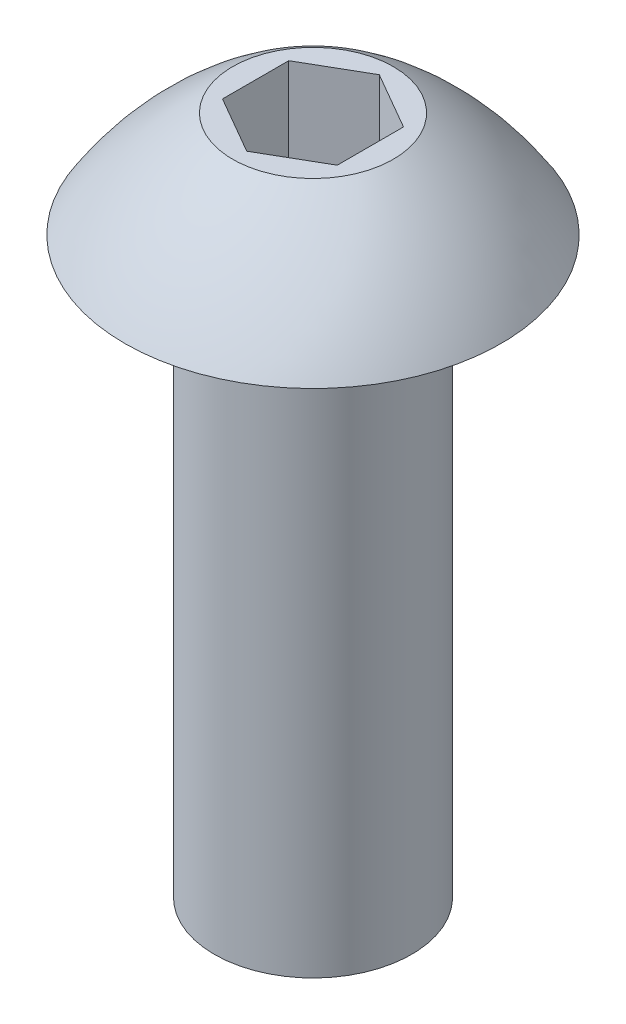
ISO-10303-21;
HEADER;
FILE_DESCRIPTION(('STEP AP214'),'2;1');
FILE_NAME('part.step','',(''),(''),'','','');
FILE_SCHEMA(('AUTOMOTIVE_DESIGN { 1 0 10303 214 1 1 1 1 }'));
ENDSEC;
DATA;
#1=APPLICATION_CONTEXT('core data for automotive mechanical design processes');
#2=APPLICATION_PROTOCOL_DEFINITION('international standard','automotive_design',2000,#1);
#3=PRODUCT_CONTEXT('',#1,'mechanical');
#4=PRODUCT('Part','Part','',(#3));
#5=PRODUCT_RELATED_PRODUCT_CATEGORY('part','',(#4));
#6=PRODUCT_DEFINITION_FORMATION('','',#4);
#7=PRODUCT_DEFINITION_CONTEXT('part definition',#1,'design');
#8=PRODUCT_DEFINITION('design','',#6,#7);
#9=PRODUCT_DEFINITION_SHAPE('','',#8);
#10=(LENGTH_UNIT() NAMED_UNIT(*) SI_UNIT(.MILLI.,.METRE.));
#11=(NAMED_UNIT(*) PLANE_ANGLE_UNIT() SI_UNIT($,.RADIAN.));
#12=(NAMED_UNIT(*) SI_UNIT($,.STERADIAN.) SOLID_ANGLE_UNIT());
#13=UNCERTAINTY_MEASURE_WITH_UNIT(LENGTH_MEASURE(1.E-05),#10,'distance_accuracy_value','');
#14=(GEOMETRIC_REPRESENTATION_CONTEXT(3) GLOBAL_UNCERTAINTY_ASSIGNED_CONTEXT((#13)) GLOBAL_UNIT_ASSIGNED_CONTEXT((#10,
#11,#12)) REPRESENTATION_CONTEXT('',''));
#15=CARTESIAN_POINT('',(0.,0.,0.));
#16=DIRECTION('',(0.,0.,1.));
#17=DIRECTION('',(1.,0.,0.));
#18=AXIS2_PLACEMENT_3D('',#15,#16,#17);
#19=CARTESIAN_POINT('',(0.,-6.35,0.));
#20=DIRECTION('',(0.,-1.,0.));
#21=DIRECTION('',(0.,0.,-1.));
#22=AXIS2_PLACEMENT_3D('',#19,#20,#21);
#23=CYLINDRICAL_SURFACE('',#22,1.0922);
#24=CARTESIAN_POINT('',(0.,-6.35,0.));
#25=DIRECTION('',(0.,-1.,0.));
#26=DIRECTION('',(0.,0.,-1.));
#27=AXIS2_PLACEMENT_3D('',#24,#25,#26);
#28=CIRCLE('',#27,1.0922);
#29=CARTESIAN_POINT('',(0.,-6.35,-1.0922));
#30=VERTEX_POINT('',#29);
#31=EDGE_CURVE('E135',#30,#30,#28,.T.);
#32=ORIENTED_EDGE('',*,*,#31,.F.);
#33=EDGE_LOOP('',(#32));
#34=FACE_BOUND('',#33,.T.);
#35=CARTESIAN_POINT('',(0.,0.,0.));
#36=DIRECTION('',(0.,-1.,0.));
#37=DIRECTION('',(0.,0.,-1.));
#38=AXIS2_PLACEMENT_3D('',#35,#36,#37);
#39=CIRCLE('',#38,1.0922);
#40=CARTESIAN_POINT('',(0.,0.,-1.0922));
#41=VERTEX_POINT('',#40);
#42=EDGE_CURVE('E11',#41,#41,#39,.T.);
#43=ORIENTED_EDGE('',*,*,#42,.T.);
#44=EDGE_LOOP('',(#43));
#45=FACE_BOUND('',#44,.T.);
#46=ADVANCED_FACE('F34',(#34,#45),#23,.T.);
#47=CARTESIAN_POINT('',(-1.0922,0.,0.));
#48=DIRECTION('',(0.,1.,0.));
#49=DIRECTION('',(0.,0.,1.));
#50=AXIS2_PLACEMENT_3D('',#47,#48,#49);
#51=PLANE('',#50);
#52=ORIENTED_EDGE('',*,*,#42,.F.);
#53=EDGE_LOOP('',(#52));
#54=FACE_BOUND('',#53,.T.);
#55=CARTESIAN_POINT('',(0.,0.,0.));
#56=DIRECTION('',(0.,-1.,0.));
#57=DIRECTION('',(0.,0.,-1.));
#58=AXIS2_PLACEMENT_3D('',#55,#56,#57);
#59=CIRCLE('',#58,2.0828);
#60=CARTESIAN_POINT('',(0.,0.,-2.0828));
#61=VERTEX_POINT('',#60);
#62=EDGE_CURVE('E41',#61,#61,#59,.T.);
#63=ORIENTED_EDGE('',*,*,#62,.T.);
#64=EDGE_LOOP('',(#63));
#65=FACE_BOUND('',#64,.T.);
#66=ADVANCED_FACE('F148',(#54,#65),#51,.F.);
#67=CARTESIAN_POINT('',(0.,-1.88994850901782,0.));
#68=DIRECTION('',(0.,-1.,0.));
#69=DIRECTION('',(0.,0.,-1.));
#70=AXIS2_PLACEMENT_3D('',#67,#68,#69);
#71=DEGENERATE_TOROIDAL_SURFACE('',#70,0.935607051379142,3.5612759643917,.F.);
#72=ORIENTED_EDGE('',*,*,#62,.F.);
#73=EDGE_LOOP('',(#72));
#74=FACE_BOUND('',#73,.T.);
#75=CARTESIAN_POINT('',(0.,1.1684,0.));
#76=DIRECTION('',(0.,-1.,0.));
#77=DIRECTION('',(0.,0.,-1.));
#78=AXIS2_PLACEMENT_3D('',#75,#76,#77);
#79=CIRCLE('',#78,0.889);
#80=CARTESIAN_POINT('',(0.,1.1684,-0.889));
#81=VERTEX_POINT('',#80);
#82=EDGE_CURVE('E143',#81,#81,#79,.T.);
#83=ORIENTED_EDGE('',*,*,#82,.T.);
#84=EDGE_LOOP('',(#83));
#85=FACE_BOUND('',#84,.T.);
#86=ADVANCED_FACE('F150',(#74,#85),#71,.F.);
#87=CARTESIAN_POINT('',(0.,1.1684,0.));
#88=DIRECTION('',(0.,-1.,0.));
#89=DIRECTION('',(0.,0.,-1.));
#90=AXIS2_PLACEMENT_3D('',#87,#88,#89);
#91=PLANE('',#90);
#92=DIRECTION('',(0.,0.,1.));
#93=VECTOR('',#92,1.);
#94=CARTESIAN_POINT('',(-0.635,1.1684,-0.366617420935412));
#95=LINE('',#94,#93);
#96=CARTESIAN_POINT('',(-0.635,1.1684,-0.366617420935412));
#97=VERTEX_POINT('',#96);
#98=CARTESIAN_POINT('',(-0.635,1.1684,0.366617420935412));
#99=VERTEX_POINT('',#98);
#100=EDGE_CURVE('E122',#97,#99,#95,.T.);
#101=ORIENTED_EDGE('',*,*,#100,.F.);
#102=DIRECTION('',(-0.866025403784438,0.,0.5));
#103=VECTOR('',#102,1.);
#104=CARTESIAN_POINT('',(0.,1.1684,-0.733234841870825));
#105=LINE('',#104,#103);
#106=CARTESIAN_POINT('',(0.,1.1684,-0.733234841870825));
#107=VERTEX_POINT('',#106);
#108=EDGE_CURVE('E48',#107,#97,#105,.T.);
#109=ORIENTED_EDGE('',*,*,#108,.F.);
#110=DIRECTION('',(-0.866025403784439,0.,-0.5));
#111=VECTOR('',#110,1.);
#112=CARTESIAN_POINT('',(0.635,1.1684,-0.366617420935413));
#113=LINE('',#112,#111);
#114=CARTESIAN_POINT('',(0.635,1.1684,-0.366617420935413));
#115=VERTEX_POINT('',#114);
#116=EDGE_CURVE('E131',#115,#107,#113,.T.);
#117=ORIENTED_EDGE('',*,*,#116,.F.);
#118=DIRECTION('',(0.,0.,-1.));
#119=VECTOR('',#118,1.);
#120=CARTESIAN_POINT('',(0.635,1.1684,0.366617420935412));
#121=LINE('',#120,#119);
#122=CARTESIAN_POINT('',(0.635,1.1684,0.366617420935412));
#123=VERTEX_POINT('',#122);
#124=EDGE_CURVE('E129',#123,#115,#121,.T.);
#125=ORIENTED_EDGE('',*,*,#124,.F.);
#126=DIRECTION('',(0.866025403784439,0.,-0.5));
#127=VECTOR('',#126,1.);
#128=CARTESIAN_POINT('',(0.,1.1684,0.733234841870825));
#129=LINE('',#128,#127);
#130=CARTESIAN_POINT('',(0.,1.1684,0.733234841870825));
#131=VERTEX_POINT('',#130);
#132=EDGE_CURVE('E96',#131,#123,#129,.T.);
#133=ORIENTED_EDGE('',*,*,#132,.F.);
#134=DIRECTION('',(0.866025403784439,0.,0.5));
#135=VECTOR('',#134,1.);
#136=CARTESIAN_POINT('',(-0.635,1.1684,0.366617420935412));
#137=LINE('',#136,#135);
#138=EDGE_CURVE('E125',#99,#131,#137,.T.);
#139=ORIENTED_EDGE('',*,*,#138,.F.);
#140=EDGE_LOOP('',(#101,#109,#117,#125,#133,#139));
#141=FACE_BOUND('',#140,.T.);
#142=ORIENTED_EDGE('',*,*,#82,.F.);
#143=EDGE_LOOP('',(#142));
#144=FACE_BOUND('',#143,.T.);
#145=ADVANCED_FACE('F153',(#141,#144),#91,.F.);
#146=CARTESIAN_POINT('',(-1.0922,-6.35,0.));
#147=DIRECTION('',(0.,1.,0.));
#148=DIRECTION('',(0.,0.,1.));
#149=AXIS2_PLACEMENT_3D('',#146,#147,#148);
#150=PLANE('',#149);
#151=ORIENTED_EDGE('',*,*,#31,.T.);
#152=EDGE_LOOP('',(#151));
#153=FACE_BOUND('',#152,.T.);
#154=ADVANCED_FACE('F158',(#153),#150,.F.);
#155=CARTESIAN_POINT('',(0.,-0.1016,-0.733234841870825));
#156=DIRECTION('',(-0.5,0.,-0.866025403784439));
#157=DIRECTION('',(-0.866025403784439,0.,0.5));
#158=AXIS2_PLACEMENT_3D('',#155,#156,#157);
#159=PLANE('',#158);
#160=ORIENTED_EDGE('',*,*,#108,.T.);
#161=DIRECTION('',(0.,1.,0.));
#162=VECTOR('',#161,1.);
#163=CARTESIAN_POINT('',(-0.635,-0.1016,-0.366617420935412));
#164=LINE('',#163,#162);
#165=CARTESIAN_POINT('',(-0.635,-0.1016,-0.366617420935412));
#166=VERTEX_POINT('',#165);
#167=EDGE_CURVE('E78',#166,#97,#164,.T.);
#168=ORIENTED_EDGE('',*,*,#167,.F.);
#169=DIRECTION('',(-0.866025403784438,0.,0.5));
#170=VECTOR('',#169,1.);
#171=CARTESIAN_POINT('',(0.,-0.1016,-0.733234841870825));
#172=LINE('',#171,#170);
#173=CARTESIAN_POINT('',(0.,-0.1016,-0.733234841870825));
#174=VERTEX_POINT('',#173);
#175=EDGE_CURVE('E133',#174,#166,#172,.T.);
#176=ORIENTED_EDGE('',*,*,#175,.F.);
#177=DIRECTION('',(0.,1.,0.));
#178=VECTOR('',#177,1.);
#179=CARTESIAN_POINT('',(0.,-0.1016,-0.733234841870825));
#180=LINE('',#179,#178);
#181=EDGE_CURVE('E56',#174,#107,#180,.T.);
#182=ORIENTED_EDGE('',*,*,#181,.T.);
#183=EDGE_LOOP('',(#160,#168,#176,#182));
#184=FACE_BOUND('',#183,.T.);
#185=ADVANCED_FACE('F164',(#184),#159,.F.);
#186=CARTESIAN_POINT('',(0.635,-0.1016,-0.366617420935413));
#187=DIRECTION('',(0.5,0.,-0.866025403784439));
#188=DIRECTION('',(-0.866025403784439,0.,-0.5));
#189=AXIS2_PLACEMENT_3D('',#186,#187,#188);
#190=PLANE('',#189);
#191=ORIENTED_EDGE('',*,*,#116,.T.);
#192=ORIENTED_EDGE('',*,*,#181,.F.);
#193=DIRECTION('',(-0.866025403784439,0.,-0.5));
#194=VECTOR('',#193,1.);
#195=CARTESIAN_POINT('',(0.635,-0.1016,-0.366617420935413));
#196=LINE('',#195,#194);
#197=CARTESIAN_POINT('',(0.635,-0.1016,-0.366617420935413));
#198=VERTEX_POINT('',#197);
#199=EDGE_CURVE('E108',#198,#174,#196,.T.);
#200=ORIENTED_EDGE('',*,*,#199,.F.);
#201=DIRECTION('',(0.,1.,0.));
#202=VECTOR('',#201,1.);
#203=CARTESIAN_POINT('',(0.635,-0.1016,-0.366617420935413));
#204=LINE('',#203,#202);
#205=EDGE_CURVE('E100',#198,#115,#204,.T.);
#206=ORIENTED_EDGE('',*,*,#205,.T.);
#207=EDGE_LOOP('',(#191,#192,#200,#206));
#208=FACE_BOUND('',#207,.T.);
#209=ADVANCED_FACE('F202',(#208),#190,.F.);
#210=CARTESIAN_POINT('',(0.635,-0.1016,0.366617420935412));
#211=DIRECTION('',(1.,0.,0.));
#212=DIRECTION('',(0.,0.,-1.));
#213=AXIS2_PLACEMENT_3D('',#210,#211,#212);
#214=PLANE('',#213);
#215=ORIENTED_EDGE('',*,*,#124,.T.);
#216=ORIENTED_EDGE('',*,*,#205,.F.);
#217=DIRECTION('',(0.,0.,-1.));
#218=VECTOR('',#217,1.);
#219=CARTESIAN_POINT('',(0.635,-0.1016,0.366617420935412));
#220=LINE('',#219,#218);
#221=CARTESIAN_POINT('',(0.635,-0.1016,0.366617420935412));
#222=VERTEX_POINT('',#221);
#223=EDGE_CURVE('E104',#222,#198,#220,.T.);
#224=ORIENTED_EDGE('',*,*,#223,.F.);
#225=DIRECTION('',(0.,1.,0.));
#226=VECTOR('',#225,1.);
#227=CARTESIAN_POINT('',(0.635,-0.1016,0.366617420935412));
#228=LINE('',#227,#226);
#229=EDGE_CURVE('E89',#222,#123,#228,.T.);
#230=ORIENTED_EDGE('',*,*,#229,.T.);
#231=EDGE_LOOP('',(#215,#216,#224,#230));
#232=FACE_BOUND('',#231,.T.);
#233=ADVANCED_FACE('F105',(#232),#214,.F.);
#234=CARTESIAN_POINT('',(0.,-0.1016,0.733234841870825));
#235=DIRECTION('',(0.5,0.,0.866025403784438));
#236=DIRECTION('',(0.866025403784439,0.,-0.5));
#237=AXIS2_PLACEMENT_3D('',#234,#235,#236);
#238=PLANE('',#237);
#239=ORIENTED_EDGE('',*,*,#132,.T.);
#240=ORIENTED_EDGE('',*,*,#229,.F.);
#241=DIRECTION('',(0.866025403784439,0.,-0.5));
#242=VECTOR('',#241,1.);
#243=CARTESIAN_POINT('',(0.,-0.1016,0.733234841870825));
#244=LINE('',#243,#242);
#245=CARTESIAN_POINT('',(0.,-0.1016,0.733234841870825));
#246=VERTEX_POINT('',#245);
#247=EDGE_CURVE('E93',#246,#222,#244,.T.);
#248=ORIENTED_EDGE('',*,*,#247,.F.);
#249=DIRECTION('',(0.,1.,0.));
#250=VECTOR('',#249,1.);
#251=CARTESIAN_POINT('',(0.,-0.1016,0.733234841870825));
#252=LINE('',#251,#250);
#253=EDGE_CURVE('E101',#246,#131,#252,.T.);
#254=ORIENTED_EDGE('',*,*,#253,.T.);
#255=EDGE_LOOP('',(#239,#240,#248,#254));
#256=FACE_BOUND('',#255,.T.);
#257=ADVANCED_FACE('F91',(#256),#238,.F.);
#258=CARTESIAN_POINT('',(-0.635,-0.1016,0.366617420935412));
#259=DIRECTION('',(-0.5,0.,0.866025403784439));
#260=DIRECTION('',(0.866025403784439,0.,0.5));
#261=AXIS2_PLACEMENT_3D('',#258,#259,#260);
#262=PLANE('',#261);
#263=ORIENTED_EDGE('',*,*,#138,.T.);
#264=ORIENTED_EDGE('',*,*,#253,.F.);
#265=DIRECTION('',(0.866025403784439,0.,0.5));
#266=VECTOR('',#265,1.);
#267=CARTESIAN_POINT('',(-0.635,-0.1016,0.366617420935412));
#268=LINE('',#267,#266);
#269=CARTESIAN_POINT('',(-0.635,-0.1016,0.366617420935412));
#270=VERTEX_POINT('',#269);
#271=EDGE_CURVE('E114',#270,#246,#268,.T.);
#272=ORIENTED_EDGE('',*,*,#271,.F.);
#273=DIRECTION('',(0.,1.,0.));
#274=VECTOR('',#273,1.);
#275=CARTESIAN_POINT('',(-0.635,-0.1016,0.366617420935412));
#276=LINE('',#275,#274);
#277=EDGE_CURVE('E138',#270,#99,#276,.T.);
#278=ORIENTED_EDGE('',*,*,#277,.T.);
#279=EDGE_LOOP('',(#263,#264,#272,#278));
#280=FACE_BOUND('',#279,.T.);
#281=ADVANCED_FACE('F227',(#280),#262,.F.);
#282=CARTESIAN_POINT('',(-0.635,-0.1016,-0.366617420935412));
#283=DIRECTION('',(-1.,0.,0.));
#284=DIRECTION('',(0.,0.,1.));
#285=AXIS2_PLACEMENT_3D('',#282,#283,#284);
#286=PLANE('',#285);
#287=ORIENTED_EDGE('',*,*,#100,.T.);
#288=ORIENTED_EDGE('',*,*,#277,.F.);
#289=DIRECTION('',(0.,0.,1.));
#290=VECTOR('',#289,1.);
#291=CARTESIAN_POINT('',(-0.635,-0.1016,-0.366617420935412));
#292=LINE('',#291,#290);
#293=EDGE_CURVE('E116',#166,#270,#292,.T.);
#294=ORIENTED_EDGE('',*,*,#293,.F.);
#295=ORIENTED_EDGE('',*,*,#167,.T.);
#296=EDGE_LOOP('',(#287,#288,#294,#295));
#297=FACE_BOUND('',#296,.T.);
#298=ADVANCED_FACE('F236',(#297),#286,.F.);
#299=CARTESIAN_POINT('',(0.,-0.1016,0.));
#300=DIRECTION('',(0.,1.,0.));
#301=DIRECTION('',(0.,0.,1.));
#302=AXIS2_PLACEMENT_3D('',#299,#300,#301);
#303=PLANE('',#302);
#304=ORIENTED_EDGE('',*,*,#175,.T.);
#305=ORIENTED_EDGE('',*,*,#293,.T.);
#306=ORIENTED_EDGE('',*,*,#271,.T.);
#307=ORIENTED_EDGE('',*,*,#247,.T.);
#308=ORIENTED_EDGE('',*,*,#223,.T.);
#309=ORIENTED_EDGE('',*,*,#199,.T.);
#310=EDGE_LOOP('',(#304,#305,#306,#307,#308,#309));
#311=FACE_BOUND('',#310,.T.);
#312=ADVANCED_FACE('F111',(#311),#303,.T.);
#313=CLOSED_SHELL('',(#46,#66,#86,#145,#154,#185,#209,#233,#257,#281,#298,#312));
#314=MANIFOLD_SOLID_BREP('B2',#313);
#315=ADVANCED_BREP_SHAPE_REPRESENTATION('',(#18,#314),#14);
#316=SHAPE_DEFINITION_REPRESENTATION(#9,#315);
ENDSEC;
END-ISO-10303-21;
